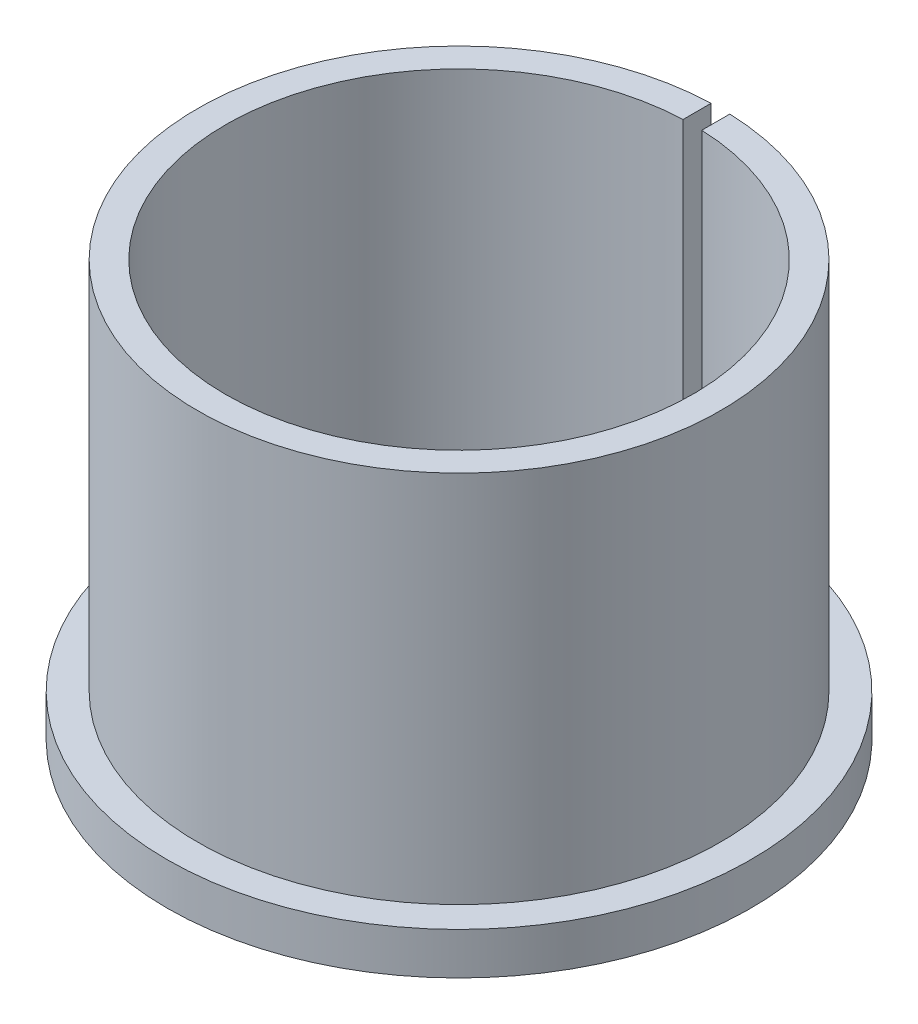
ISO-10303-21;
HEADER;
FILE_DESCRIPTION(('STEP AP214'),'2;1');
FILE_NAME('part.step','',(''),(''),'','','');
FILE_SCHEMA(('AUTOMOTIVE_DESIGN { 1 0 10303 214 1 1 1 1 }'));
ENDSEC;
DATA;
#1=APPLICATION_CONTEXT('core data for automotive mechanical design processes');
#2=APPLICATION_PROTOCOL_DEFINITION('international standard','automotive_design',2000,#1);
#3=PRODUCT_CONTEXT('',#1,'mechanical');
#4=PRODUCT('Part','Part','',(#3));
#5=PRODUCT_RELATED_PRODUCT_CATEGORY('part','',(#4));
#6=PRODUCT_DEFINITION_FORMATION('','',#4);
#7=PRODUCT_DEFINITION_CONTEXT('part definition',#1,'design');
#8=PRODUCT_DEFINITION('design','',#6,#7);
#9=PRODUCT_DEFINITION_SHAPE('','',#8);
#10=(LENGTH_UNIT() NAMED_UNIT(*) SI_UNIT(.MILLI.,.METRE.));
#11=(NAMED_UNIT(*) PLANE_ANGLE_UNIT() SI_UNIT($,.RADIAN.));
#12=(NAMED_UNIT(*) SI_UNIT($,.STERADIAN.) SOLID_ANGLE_UNIT());
#13=UNCERTAINTY_MEASURE_WITH_UNIT(LENGTH_MEASURE(1.E-05),#10,'distance_accuracy_value','');
#14=(GEOMETRIC_REPRESENTATION_CONTEXT(3) GLOBAL_UNCERTAINTY_ASSIGNED_CONTEXT((#13)) GLOBAL_UNIT_ASSIGNED_CONTEXT((#10,
#11,#12)) REPRESENTATION_CONTEXT('',''));
#15=CARTESIAN_POINT('',(0.,0.,0.));
#16=DIRECTION('',(0.,0.,1.));
#17=DIRECTION('',(1.,0.,0.));
#18=AXIS2_PLACEMENT_3D('',#15,#16,#17);
#19=CARTESIAN_POINT('',(0.,44.5,-28.));
#20=DIRECTION('',(0.,1.,0.));
#21=DIRECTION('',(0.,0.,1.));
#22=AXIS2_PLACEMENT_3D('',#19,#20,#21);
#23=PLANE('',#22);
#24=DIRECTION('',(0.,0.,1.));
#25=VECTOR('',#24,1.);
#26=CARTESIAN_POINT('',(1.,44.5,-31.25));
#27=LINE('',#26,#25);
#28=CARTESIAN_POINT('',(1.,44.5,-27.9821371592664));
#29=VERTEX_POINT('',#28);
#30=CARTESIAN_POINT('',(1.,44.5,-24.9799919935936));
#31=VERTEX_POINT('',#30);
#32=EDGE_CURVE('E56',#29,#31,#27,.T.);
#33=ORIENTED_EDGE('',*,*,#32,.T.);
#34=CARTESIAN_POINT('',(0.,44.5,0.));
#35=DIRECTION('',(0.,-1.,0.));
#36=DIRECTION('',(0.,0.,-1.));
#37=AXIS2_PLACEMENT_3D('',#34,#35,#36);
#38=CIRCLE('',#37,25.);
#39=CARTESIAN_POINT('',(-1.,44.5,-24.9799919935936));
#40=VERTEX_POINT('',#39);
#41=EDGE_CURVE('E99',#31,#40,#38,.T.);
#42=ORIENTED_EDGE('',*,*,#41,.T.);
#43=DIRECTION('',(0.,0.,1.));
#44=VECTOR('',#43,1.);
#45=CARTESIAN_POINT('',(-1.,44.5,-31.25));
#46=LINE('',#45,#44);
#47=CARTESIAN_POINT('',(-1.,44.5,-27.9821371592664));
#48=VERTEX_POINT('',#47);
#49=EDGE_CURVE('E101',#48,#40,#46,.T.);
#50=ORIENTED_EDGE('',*,*,#49,.F.);
#51=CARTESIAN_POINT('',(0.,44.5,0.));
#52=DIRECTION('',(0.,-1.,0.));
#53=DIRECTION('',(0.,0.,-1.));
#54=AXIS2_PLACEMENT_3D('',#51,#52,#53);
#55=CIRCLE('',#54,28.);
#56=EDGE_CURVE('E92',#29,#48,#55,.T.);
#57=ORIENTED_EDGE('',*,*,#56,.F.);
#58=EDGE_LOOP('',(#33,#42,#50,#57));
#59=FACE_BOUND('',#58,.T.);
#60=ADVANCED_FACE('F35',(#59),#23,.T.);
#61=CARTESIAN_POINT('',(0.,0.,0.));
#62=DIRECTION('',(0.,-1.,0.));
#63=DIRECTION('',(0.,0.,-1.));
#64=AXIS2_PLACEMENT_3D('',#61,#62,#63);
#65=CYLINDRICAL_SURFACE('',#64,25.);
#66=DIRECTION('',(0.,-1.,0.));
#67=VECTOR('',#66,1.);
#68=CARTESIAN_POINT('',(1.,0.,-24.9799919935936));
#69=LINE('',#68,#67);
#70=CARTESIAN_POINT('',(1.,0.,-24.9799919935936));
#71=VERTEX_POINT('',#70);
#72=EDGE_CURVE('E84',#71,#31,#69,.F.);
#73=ORIENTED_EDGE('',*,*,#72,.F.);
#74=CARTESIAN_POINT('',(0.,0.,0.));
#75=DIRECTION('',(0.,-1.,0.));
#76=DIRECTION('',(0.,0.,-1.));
#77=AXIS2_PLACEMENT_3D('',#74,#75,#76);
#78=CIRCLE('',#77,25.);
#79=CARTESIAN_POINT('',(-1.,0.,-24.9799919935936));
#80=VERTEX_POINT('',#79);
#81=EDGE_CURVE('E106',#71,#80,#78,.T.);
#82=ORIENTED_EDGE('',*,*,#81,.T.);
#83=DIRECTION('',(0.,-1.,0.));
#84=VECTOR('',#83,1.);
#85=CARTESIAN_POINT('',(-1.,0.,-24.9799919935936));
#86=LINE('',#85,#84);
#87=EDGE_CURVE('E105',#40,#80,#86,.T.);
#88=ORIENTED_EDGE('',*,*,#87,.F.);
#89=ORIENTED_EDGE('',*,*,#41,.F.);
#90=EDGE_LOOP('',(#73,#82,#88,#89));
#91=FACE_BOUND('',#90,.T.);
#92=ADVANCED_FACE('F104',(#91),#65,.F.);
#93=CARTESIAN_POINT('',(0.,0.,-25.));
#94=DIRECTION('',(0.,-1.,0.));
#95=DIRECTION('',(0.,0.,-1.));
#96=AXIS2_PLACEMENT_3D('',#93,#94,#95);
#97=PLANE('',#96);
#98=DIRECTION('',(0.,0.,1.));
#99=VECTOR('',#98,1.);
#100=CARTESIAN_POINT('',(1.,0.,-31.25));
#101=LINE('',#100,#99);
#102=CARTESIAN_POINT('',(1.,0.,-31.2339959019015));
#103=VERTEX_POINT('',#102);
#104=EDGE_CURVE('E87',#103,#71,#101,.T.);
#105=ORIENTED_EDGE('',*,*,#104,.F.);
#106=CARTESIAN_POINT('',(0.,0.,0.));
#107=DIRECTION('',(0.,-1.,0.));
#108=DIRECTION('',(0.,0.,-1.));
#109=AXIS2_PLACEMENT_3D('',#106,#107,#108);
#110=CIRCLE('',#109,31.25);
#111=CARTESIAN_POINT('',(-1.,0.,-31.2339959019015));
#112=VERTEX_POINT('',#111);
#113=EDGE_CURVE('E108',#103,#112,#110,.T.);
#114=ORIENTED_EDGE('',*,*,#113,.T.);
#115=DIRECTION('',(0.,0.,1.));
#116=VECTOR('',#115,1.);
#117=CARTESIAN_POINT('',(-1.,0.,-31.25));
#118=LINE('',#117,#116);
#119=EDGE_CURVE('E128',#112,#80,#118,.T.);
#120=ORIENTED_EDGE('',*,*,#119,.T.);
#121=ORIENTED_EDGE('',*,*,#81,.F.);
#122=EDGE_LOOP('',(#105,#114,#120,#121));
#123=FACE_BOUND('',#122,.T.);
#124=ADVANCED_FACE('F132',(#123),#97,.T.);
#125=CARTESIAN_POINT('',(0.,0.,0.));
#126=DIRECTION('',(0.,-1.,0.));
#127=DIRECTION('',(0.,0.,-1.));
#128=AXIS2_PLACEMENT_3D('',#125,#126,#127);
#129=CYLINDRICAL_SURFACE('',#128,31.25);
#130=DIRECTION('',(0.,-1.,0.));
#131=VECTOR('',#130,1.);
#132=CARTESIAN_POINT('',(1.,0.,-31.2339959019015));
#133=LINE('',#132,#131);
#134=CARTESIAN_POINT('',(1.,4.5,-31.2339959019015));
#135=VERTEX_POINT('',#134);
#136=EDGE_CURVE('E93',#135,#103,#133,.T.);
#137=ORIENTED_EDGE('',*,*,#136,.F.);
#138=CARTESIAN_POINT('',(0.,4.5,0.));
#139=DIRECTION('',(0.,-1.,0.));
#140=DIRECTION('',(0.,0.,-1.));
#141=AXIS2_PLACEMENT_3D('',#138,#139,#140);
#142=CIRCLE('',#141,31.25);
#143=CARTESIAN_POINT('',(-1.,4.5,-31.2339959019015));
#144=VERTEX_POINT('',#143);
#145=EDGE_CURVE('E113',#135,#144,#142,.T.);
#146=ORIENTED_EDGE('',*,*,#145,.T.);
#147=DIRECTION('',(0.,-1.,0.));
#148=VECTOR('',#147,1.);
#149=CARTESIAN_POINT('',(-1.,0.,-31.2339959019015));
#150=LINE('',#149,#148);
#151=EDGE_CURVE('E124',#112,#144,#150,.F.);
#152=ORIENTED_EDGE('',*,*,#151,.F.);
#153=ORIENTED_EDGE('',*,*,#113,.F.);
#154=EDGE_LOOP('',(#137,#146,#152,#153));
#155=FACE_BOUND('',#154,.T.);
#156=ADVANCED_FACE('F138',(#155),#129,.T.);
#157=CARTESIAN_POINT('',(0.,4.5,-31.25));
#158=DIRECTION('',(0.,1.,0.));
#159=DIRECTION('',(0.,0.,1.));
#160=AXIS2_PLACEMENT_3D('',#157,#158,#159);
#161=PLANE('',#160);
#162=DIRECTION('',(0.,0.,-1.));
#163=VECTOR('',#162,1.);
#164=CARTESIAN_POINT('',(1.,4.5,-31.25));
#165=LINE('',#164,#163);
#166=CARTESIAN_POINT('',(1.,4.5,-27.9821371592664));
#167=VERTEX_POINT('',#166);
#168=EDGE_CURVE('E121',#167,#135,#165,.T.);
#169=ORIENTED_EDGE('',*,*,#168,.F.);
#170=CARTESIAN_POINT('',(0.,4.5,0.));
#171=DIRECTION('',(0.,-1.,0.));
#172=DIRECTION('',(0.,0.,-1.));
#173=AXIS2_PLACEMENT_3D('',#170,#171,#172);
#174=CIRCLE('',#173,28.);
#175=CARTESIAN_POINT('',(-1.,4.5,-27.9821371592664));
#176=VERTEX_POINT('',#175);
#177=EDGE_CURVE('E116',#167,#176,#174,.T.);
#178=ORIENTED_EDGE('',*,*,#177,.T.);
#179=DIRECTION('',(0.,0.,1.));
#180=VECTOR('',#179,1.);
#181=CARTESIAN_POINT('',(-1.,4.5,-31.25));
#182=LINE('',#181,#180);
#183=EDGE_CURVE('E49',#144,#176,#182,.T.);
#184=ORIENTED_EDGE('',*,*,#183,.F.);
#185=ORIENTED_EDGE('',*,*,#145,.F.);
#186=EDGE_LOOP('',(#169,#178,#184,#185));
#187=FACE_BOUND('',#186,.T.);
#188=ADVANCED_FACE('F142',(#187),#161,.T.);
#189=CARTESIAN_POINT('',(0.,0.,0.));
#190=DIRECTION('',(0.,-1.,0.));
#191=DIRECTION('',(0.,0.,-1.));
#192=AXIS2_PLACEMENT_3D('',#189,#190,#191);
#193=CYLINDRICAL_SURFACE('',#192,28.);
#194=DIRECTION('',(0.,-1.,0.));
#195=VECTOR('',#194,1.);
#196=CARTESIAN_POINT('',(1.,0.,-27.9821371592664));
#197=LINE('',#196,#195);
#198=EDGE_CURVE('E11',#29,#167,#197,.T.);
#199=ORIENTED_EDGE('',*,*,#198,.F.);
#200=ORIENTED_EDGE('',*,*,#56,.T.);
#201=DIRECTION('',(0.,-1.,0.));
#202=VECTOR('',#201,1.);
#203=CARTESIAN_POINT('',(-1.,0.,-27.9821371592664));
#204=LINE('',#203,#202);
#205=EDGE_CURVE('E42',#176,#48,#204,.F.);
#206=ORIENTED_EDGE('',*,*,#205,.F.);
#207=ORIENTED_EDGE('',*,*,#177,.F.);
#208=EDGE_LOOP('',(#199,#200,#206,#207));
#209=FACE_BOUND('',#208,.T.);
#210=ADVANCED_FACE('F145',(#209),#193,.T.);
#211=CARTESIAN_POINT('',(-1.,0.,-31.25));
#212=DIRECTION('',(-1.,0.,0.));
#213=DIRECTION('',(0.,0.,1.));
#214=AXIS2_PLACEMENT_3D('',#211,#212,#213);
#215=PLANE('',#214);
#216=ORIENTED_EDGE('',*,*,#87,.T.);
#217=ORIENTED_EDGE('',*,*,#119,.F.);
#218=ORIENTED_EDGE('',*,*,#151,.T.);
#219=ORIENTED_EDGE('',*,*,#183,.T.);
#220=ORIENTED_EDGE('',*,*,#205,.T.);
#221=ORIENTED_EDGE('',*,*,#49,.T.);
#222=EDGE_LOOP('',(#216,#217,#218,#219,#220,#221));
#223=FACE_BOUND('',#222,.T.);
#224=ADVANCED_FACE('F135',(#223),#215,.F.);
#225=CARTESIAN_POINT('',(1.,0.,-31.25));
#226=DIRECTION('',(1.,0.,0.));
#227=DIRECTION('',(0.,0.,-1.));
#228=AXIS2_PLACEMENT_3D('',#225,#226,#227);
#229=PLANE('',#228);
#230=ORIENTED_EDGE('',*,*,#72,.T.);
#231=ORIENTED_EDGE('',*,*,#32,.F.);
#232=ORIENTED_EDGE('',*,*,#198,.T.);
#233=ORIENTED_EDGE('',*,*,#168,.T.);
#234=ORIENTED_EDGE('',*,*,#136,.T.);
#235=ORIENTED_EDGE('',*,*,#104,.T.);
#236=EDGE_LOOP('',(#230,#231,#232,#233,#234,#235));
#237=FACE_BOUND('',#236,.T.);
#238=ADVANCED_FACE('F85',(#237),#229,.F.);
#239=CLOSED_SHELL('',(#60,#92,#124,#156,#188,#210,#224,#238));
#240=MANIFOLD_SOLID_BREP('B2',#239);
#241=ADVANCED_BREP_SHAPE_REPRESENTATION('',(#18,#240),#14);
#242=SHAPE_DEFINITION_REPRESENTATION(#9,#241);
ENDSEC;
END-ISO-10303-21;
